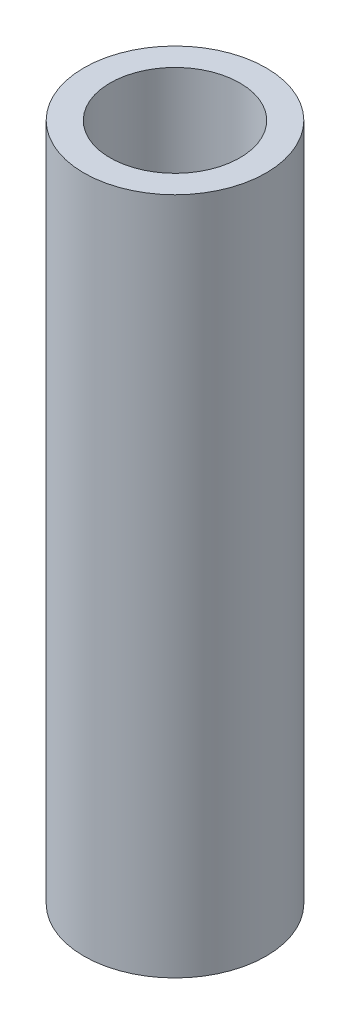
ISO-10303-21;
HEADER;
FILE_DESCRIPTION(('STEP AP214'),'2;1');
FILE_NAME('part.step','',(''),(''),'','','');
FILE_SCHEMA(('AUTOMOTIVE_DESIGN { 1 0 10303 214 1 1 1 1 }'));
ENDSEC;
DATA;
#1=APPLICATION_CONTEXT('core data for automotive mechanical design processes');
#2=APPLICATION_PROTOCOL_DEFINITION('international standard','automotive_design',2000,#1);
#3=PRODUCT_CONTEXT('',#1,'mechanical');
#4=PRODUCT('Part','Part','',(#3));
#5=PRODUCT_RELATED_PRODUCT_CATEGORY('part','',(#4));
#6=PRODUCT_DEFINITION_FORMATION('','',#4);
#7=PRODUCT_DEFINITION_CONTEXT('part definition',#1,'design');
#8=PRODUCT_DEFINITION('design','',#6,#7);
#9=PRODUCT_DEFINITION_SHAPE('','',#8);
#10=(LENGTH_UNIT() NAMED_UNIT(*) SI_UNIT(.MILLI.,.METRE.));
#11=(NAMED_UNIT(*) PLANE_ANGLE_UNIT() SI_UNIT($,.RADIAN.));
#12=(NAMED_UNIT(*) SI_UNIT($,.STERADIAN.) SOLID_ANGLE_UNIT());
#13=UNCERTAINTY_MEASURE_WITH_UNIT(LENGTH_MEASURE(1.E-05),#10,'distance_accuracy_value','');
#14=(GEOMETRIC_REPRESENTATION_CONTEXT(3) GLOBAL_UNCERTAINTY_ASSIGNED_CONTEXT((#13)) GLOBAL_UNIT_ASSIGNED_CONTEXT((#10,
#11,#12)) REPRESENTATION_CONTEXT('',''));
#15=CARTESIAN_POINT('',(0.,0.,0.));
#16=DIRECTION('',(0.,0.,1.));
#17=DIRECTION('',(1.,0.,0.));
#18=AXIS2_PLACEMENT_3D('',#15,#16,#17);
#19=CARTESIAN_POINT('',(0.,-69.088,0.));
#20=DIRECTION('',(0.,-1.,0.));
#21=DIRECTION('',(0.,0.,-1.));
#22=AXIS2_PLACEMENT_3D('',#19,#20,#21);
#23=PLANE('',#22);
#24=CARTESIAN_POINT('',(0.,-69.088,0.));
#25=DIRECTION('',(0.,-1.,0.));
#26=DIRECTION('',(0.,0.,-1.));
#27=AXIS2_PLACEMENT_3D('',#24,#25,#26);
#28=CIRCLE('',#27,9.27986149108558);
#29=CARTESIAN_POINT('',(0.,-69.088,-9.27986149108558));
#30=VERTEX_POINT('',#29);
#31=EDGE_CURVE('E10',#30,#30,#28,.T.);
#32=ORIENTED_EDGE('',*,*,#31,.T.);
#33=EDGE_LOOP('',(#32));
#34=FACE_BOUND('',#33,.T.);
#35=CARTESIAN_POINT('',(0.,-69.088,0.));
#36=DIRECTION('',(0.,-1.,0.));
#37=DIRECTION('',(0.,0.,-1.));
#38=AXIS2_PLACEMENT_3D('',#35,#36,#37);
#39=CIRCLE('',#38,6.60908);
#40=CARTESIAN_POINT('',(0.,-69.088,-6.60908));
#41=VERTEX_POINT('',#40);
#42=EDGE_CURVE('E42',#41,#41,#39,.T.);
#43=ORIENTED_EDGE('',*,*,#42,.F.);
#44=EDGE_LOOP('',(#43));
#45=FACE_BOUND('',#44,.T.);
#46=ADVANCED_FACE('F31',(#34,#45),#23,.T.);
#47=CARTESIAN_POINT('',(0.,0.,0.));
#48=DIRECTION('',(0.,-1.,0.));
#49=DIRECTION('',(0.,0.,-1.));
#50=AXIS2_PLACEMENT_3D('',#47,#48,#49);
#51=PLANE('',#50);
#52=CARTESIAN_POINT('',(0.,0.,0.));
#53=DIRECTION('',(0.,-1.,0.));
#54=DIRECTION('',(0.,0.,-1.));
#55=AXIS2_PLACEMENT_3D('',#52,#53,#54);
#56=CIRCLE('',#55,9.27986149108558);
#57=CARTESIAN_POINT('',(0.,0.,-9.27986149108558));
#58=VERTEX_POINT('',#57);
#59=EDGE_CURVE('E35',#58,#58,#56,.T.);
#60=ORIENTED_EDGE('',*,*,#59,.F.);
#61=EDGE_LOOP('',(#60));
#62=FACE_BOUND('',#61,.T.);
#63=CARTESIAN_POINT('',(0.,0.,0.));
#64=DIRECTION('',(0.,-1.,0.));
#65=DIRECTION('',(0.,0.,-1.));
#66=AXIS2_PLACEMENT_3D('',#63,#64,#65);
#67=CIRCLE('',#66,6.60908);
#68=CARTESIAN_POINT('',(0.,0.,-6.60908));
#69=VERTEX_POINT('',#68);
#70=EDGE_CURVE('E44',#69,#69,#67,.T.);
#71=ORIENTED_EDGE('',*,*,#70,.T.);
#72=EDGE_LOOP('',(#71));
#73=FACE_BOUND('',#72,.T.);
#74=ADVANCED_FACE('F54',(#62,#73),#51,.F.);
#75=CARTESIAN_POINT('',(0.,-69.088,0.));
#76=DIRECTION('',(0.,1.,0.));
#77=DIRECTION('',(0.,0.,1.));
#78=AXIS2_PLACEMENT_3D('',#75,#76,#77);
#79=CYLINDRICAL_SURFACE('',#78,9.27986149108558);
#80=ORIENTED_EDGE('',*,*,#31,.F.);
#81=EDGE_LOOP('',(#80));
#82=FACE_BOUND('',#81,.T.);
#83=ORIENTED_EDGE('',*,*,#59,.T.);
#84=EDGE_LOOP('',(#83));
#85=FACE_BOUND('',#84,.T.);
#86=ADVANCED_FACE('F33',(#82,#85),#79,.T.);
#87=CARTESIAN_POINT('',(0.,-69.088,0.));
#88=DIRECTION('',(0.,1.,0.));
#89=DIRECTION('',(0.,0.,1.));
#90=AXIS2_PLACEMENT_3D('',#87,#88,#89);
#91=CYLINDRICAL_SURFACE('',#90,6.60908);
#92=ORIENTED_EDGE('',*,*,#42,.T.);
#93=EDGE_LOOP('',(#92));
#94=FACE_BOUND('',#93,.T.);
#95=ORIENTED_EDGE('',*,*,#70,.F.);
#96=EDGE_LOOP('',(#95));
#97=FACE_BOUND('',#96,.T.);
#98=ADVANCED_FACE('F50',(#94,#97),#91,.F.);
#99=CLOSED_SHELL('',(#46,#74,#86,#98));
#100=MANIFOLD_SOLID_BREP('B2',#99);
#101=ADVANCED_BREP_SHAPE_REPRESENTATION('',(#18,#100),#14);
#102=SHAPE_DEFINITION_REPRESENTATION(#9,#101);
ENDSEC;
END-ISO-10303-21;
